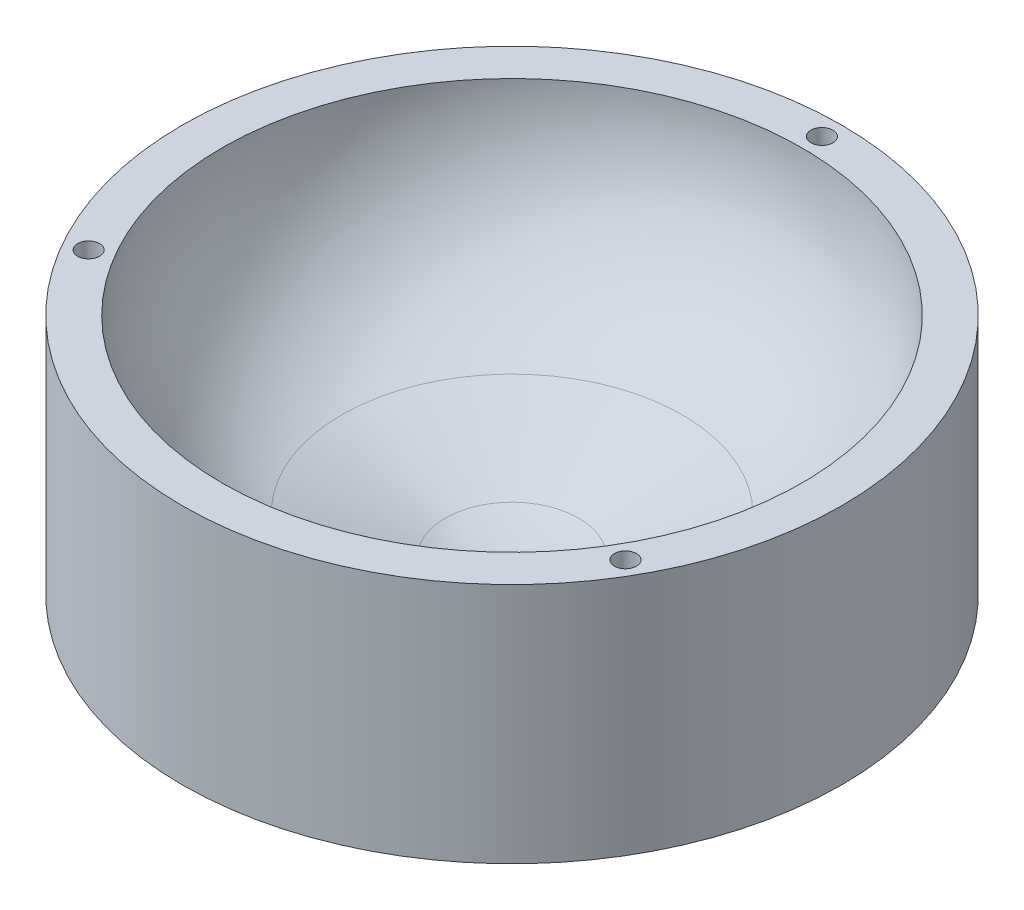
ISO-10303-21;
HEADER;
FILE_DESCRIPTION(('STEP AP214'),'2;1');
FILE_NAME('part.step','',(''),(''),'','','');
FILE_SCHEMA(('AUTOMOTIVE_DESIGN { 1 0 10303 214 1 1 1 1 }'));
ENDSEC;
DATA;
#1=APPLICATION_CONTEXT('core data for automotive mechanical design processes');
#2=APPLICATION_PROTOCOL_DEFINITION('international standard','automotive_design',2000,#1);
#3=PRODUCT_CONTEXT('',#1,'mechanical');
#4=PRODUCT('Part','Part','',(#3));
#5=PRODUCT_RELATED_PRODUCT_CATEGORY('part','',(#4));
#6=PRODUCT_DEFINITION_FORMATION('','',#4);
#7=PRODUCT_DEFINITION_CONTEXT('part definition',#1,'design');
#8=PRODUCT_DEFINITION('design','',#6,#7);
#9=PRODUCT_DEFINITION_SHAPE('','',#8);
#10=(LENGTH_UNIT() NAMED_UNIT(*) SI_UNIT(.MILLI.,.METRE.));
#11=(NAMED_UNIT(*) PLANE_ANGLE_UNIT() SI_UNIT($,.RADIAN.));
#12=(NAMED_UNIT(*) SI_UNIT($,.STERADIAN.) SOLID_ANGLE_UNIT());
#13=UNCERTAINTY_MEASURE_WITH_UNIT(LENGTH_MEASURE(1.E-05),#10,'distance_accuracy_value','');
#14=(GEOMETRIC_REPRESENTATION_CONTEXT(3) GLOBAL_UNCERTAINTY_ASSIGNED_CONTEXT((#13)) GLOBAL_UNIT_ASSIGNED_CONTEXT((#10,
#11,#12)) REPRESENTATION_CONTEXT('',''));
#15=CARTESIAN_POINT('',(0.,0.,0.));
#16=DIRECTION('',(0.,0.,1.));
#17=DIRECTION('',(1.,0.,0.));
#18=AXIS2_PLACEMENT_3D('',#15,#16,#17);
#19=CARTESIAN_POINT('',(0.,34.925,0.));
#20=DIRECTION('',(0.,-1.,0.));
#21=DIRECTION('',(0.,0.,-1.));
#22=AXIS2_PLACEMENT_3D('',#19,#20,#21);
#23=CYLINDRICAL_SURFACE('',#22,95.25);
#24=CARTESIAN_POINT('',(0.,34.925,0.));
#25=DIRECTION('',(0.,1.,0.));
#26=DIRECTION('',(0.,0.,1.));
#27=AXIS2_PLACEMENT_3D('',#24,#25,#26);
#28=CIRCLE('',#27,95.25);
#29=CARTESIAN_POINT('',(0.,34.925,95.25));
#30=VERTEX_POINT('',#29);
#31=EDGE_CURVE('E10',#30,#30,#28,.T.);
#32=ORIENTED_EDGE('',*,*,#31,.F.);
#33=EDGE_LOOP('',(#32));
#34=FACE_BOUND('',#33,.T.);
#35=CARTESIAN_POINT('',(0.,-34.925,0.));
#36=DIRECTION('',(0.,1.,0.));
#37=DIRECTION('',(0.,0.,1.));
#38=AXIS2_PLACEMENT_3D('',#35,#36,#37);
#39=CIRCLE('',#38,95.25);
#40=CARTESIAN_POINT('',(0.,-34.925,95.25));
#41=VERTEX_POINT('',#40);
#42=EDGE_CURVE('E44',#41,#41,#39,.T.);
#43=ORIENTED_EDGE('',*,*,#42,.T.);
#44=EDGE_LOOP('',(#43));
#45=FACE_BOUND('',#44,.T.);
#46=ADVANCED_FACE('F36',(#34,#45),#23,.T.);
#47=CARTESIAN_POINT('',(0.,34.925,0.));
#48=DIRECTION('',(0.,1.,0.));
#49=DIRECTION('',(0.,0.,1.));
#50=AXIS2_PLACEMENT_3D('',#47,#48,#49);
#51=PLANE('',#50);
#52=CARTESIAN_POINT('',(-77.5395845278395,34.925,44.7675000000004));
#53=DIRECTION('',(0.,1.,0.));
#54=DIRECTION('',(0.866025403784436,0.,-0.500000000000004));
#55=AXIS2_PLACEMENT_3D('',#52,#53,#54);
#56=CIRCLE('',#55,3.175);
#57=CARTESIAN_POINT('',(-74.7899538708239,34.925,43.1800000000003));
#58=VERTEX_POINT('',#57);
#59=EDGE_CURVE('E81',#58,#58,#56,.T.);
#60=ORIENTED_EDGE('',*,*,#59,.F.);
#61=EDGE_LOOP('',(#60));
#62=FACE_BOUND('',#61,.T.);
#63=CARTESIAN_POINT('',(77.5395845278401,34.925,44.7674999999993));
#64=DIRECTION('',(0.,1.,0.));
#65=DIRECTION('',(-0.866025403784443,0.,-0.499999999999992));
#66=AXIS2_PLACEMENT_3D('',#63,#64,#65);
#67=CIRCLE('',#66,3.175);
#68=CARTESIAN_POINT('',(74.7899538708245,34.925,43.1799999999993));
#69=VERTEX_POINT('',#68);
#70=EDGE_CURVE('E58',#69,#69,#67,.T.);
#71=ORIENTED_EDGE('',*,*,#70,.F.);
#72=EDGE_LOOP('',(#71));
#73=FACE_BOUND('',#72,.T.);
#74=CARTESIAN_POINT('',(0.,34.925,-89.535));
#75=DIRECTION('',(0.,1.,0.));
#76=DIRECTION('',(0.,0.,1.));
#77=AXIS2_PLACEMENT_3D('',#74,#75,#76);
#78=CIRCLE('',#77,3.175);
#79=CARTESIAN_POINT('',(0.,34.925,-86.36));
#80=VERTEX_POINT('',#79);
#81=EDGE_CURVE('E90',#80,#80,#78,.T.);
#82=ORIENTED_EDGE('',*,*,#81,.F.);
#83=EDGE_LOOP('',(#82));
#84=FACE_BOUND('',#83,.T.);
#85=CARTESIAN_POINT('',(0.,34.925,0.));
#86=DIRECTION('',(0.,1.,0.));
#87=DIRECTION('',(0.812302898165273,0.,0.583235802769599));
#88=AXIS2_PLACEMENT_3D('',#85,#86,#87);
#89=CIRCLE('',#88,83.82000259929);
#90=CARTESIAN_POINT('',(68.087231035624,34.925,48.8868265041468));
#91=VERTEX_POINT('',#90);
#92=EDGE_CURVE('E104',#91,#91,#89,.T.);
#93=ORIENTED_EDGE('',*,*,#92,.F.);
#94=EDGE_LOOP('',(#93));
#95=FACE_BOUND('',#94,.T.);
#96=ORIENTED_EDGE('',*,*,#31,.T.);
#97=EDGE_LOOP('',(#96));
#98=FACE_BOUND('',#97,.T.);
#99=ADVANCED_FACE('F136',(#62,#73,#84,#95,#98),#51,.T.);
#100=CARTESIAN_POINT('',(0.,-34.925,0.));
#101=DIRECTION('',(0.,1.,0.));
#102=DIRECTION('',(0.,0.,1.));
#103=AXIS2_PLACEMENT_3D('',#100,#101,#102);
#104=PLANE('',#103);
#105=CARTESIAN_POINT('',(-6.24500451351651E-13,-34.925,89.535));
#106=DIRECTION('',(0.,1.,0.));
#107=DIRECTION('',(0.,0.,1.));
#108=AXIS2_PLACEMENT_3D('',#105,#106,#107);
#109=CIRCLE('',#108,3.175);
#110=CARTESIAN_POINT('',(-6.24500451351651E-13,-34.925,92.71));
#111=VERTEX_POINT('',#110);
#112=EDGE_CURVE('E39',#111,#111,#109,.T.);
#113=ORIENTED_EDGE('',*,*,#112,.T.);
#114=EDGE_LOOP('',(#113));
#115=FACE_BOUND('',#114,.T.);
#116=CARTESIAN_POINT('',(-77.5395845278392,-34.925,-44.7675000000009));
#117=DIRECTION('',(0.,1.,0.));
#118=DIRECTION('',(0.,0.,1.));
#119=AXIS2_PLACEMENT_3D('',#116,#117,#118);
#120=CIRCLE('',#119,3.175);
#121=CARTESIAN_POINT('',(-77.5395845278392,-34.925,-41.5925000000009));
#122=VERTEX_POINT('',#121);
#123=EDGE_CURVE('E60',#122,#122,#120,.T.);
#124=ORIENTED_EDGE('',*,*,#123,.T.);
#125=EDGE_LOOP('',(#124));
#126=FACE_BOUND('',#125,.T.);
#127=CARTESIAN_POINT('',(77.5395845278398,-34.925,-44.7674999999998));
#128=DIRECTION('',(0.,1.,0.));
#129=DIRECTION('',(0.,0.,1.));
#130=AXIS2_PLACEMENT_3D('',#127,#128,#129);
#131=CIRCLE('',#130,3.175);
#132=CARTESIAN_POINT('',(77.5395845278398,-34.925,-41.5924999999998));
#133=VERTEX_POINT('',#132);
#134=EDGE_CURVE('E55',#133,#133,#131,.T.);
#135=ORIENTED_EDGE('',*,*,#134,.T.);
#136=EDGE_LOOP('',(#135));
#137=FACE_BOUND('',#136,.T.);
#138=CARTESIAN_POINT('',(-77.5395845278395,-34.925,44.7675000000004));
#139=DIRECTION('',(0.,1.,0.));
#140=DIRECTION('',(0.,0.,1.));
#141=AXIS2_PLACEMENT_3D('',#138,#139,#140);
#142=CIRCLE('',#141,3.175);
#143=CARTESIAN_POINT('',(-77.5395845278395,-34.925,47.9425000000004));
#144=VERTEX_POINT('',#143);
#145=EDGE_CURVE('E85',#144,#144,#142,.F.);
#146=ORIENTED_EDGE('',*,*,#145,.F.);
#147=EDGE_LOOP('',(#146));
#148=FACE_BOUND('',#147,.T.);
#149=CARTESIAN_POINT('',(77.5395845278401,-34.925,44.7674999999993));
#150=DIRECTION('',(0.,1.,0.));
#151=DIRECTION('',(0.,0.,1.));
#152=AXIS2_PLACEMENT_3D('',#149,#150,#151);
#153=CIRCLE('',#152,3.175);
#154=CARTESIAN_POINT('',(77.5395845278401,-34.925,47.9424999999993));
#155=VERTEX_POINT('',#154);
#156=EDGE_CURVE('E86',#155,#155,#153,.F.);
#157=ORIENTED_EDGE('',*,*,#156,.F.);
#158=EDGE_LOOP('',(#157));
#159=FACE_BOUND('',#158,.T.);
#160=CARTESIAN_POINT('',(0.,-34.925,-89.535));
#161=DIRECTION('',(0.,1.,0.));
#162=DIRECTION('',(0.,0.,1.));
#163=AXIS2_PLACEMENT_3D('',#160,#161,#162);
#164=CIRCLE('',#163,3.175);
#165=CARTESIAN_POINT('',(0.,-34.925,-86.36));
#166=VERTEX_POINT('',#165);
#167=EDGE_CURVE('E100',#166,#166,#164,.F.);
#168=ORIENTED_EDGE('',*,*,#167,.F.);
#169=EDGE_LOOP('',(#168));
#170=FACE_BOUND('',#169,.T.);
#171=ORIENTED_EDGE('',*,*,#42,.F.);
#172=EDGE_LOOP('',(#171));
#173=FACE_BOUND('',#172,.T.);
#174=ADVANCED_FACE('F133',(#115,#126,#137,#148,#159,#170,#173),#104,.F.);
#175=CARTESIAN_POINT('',(0.,-28.7522112769801,0.));
#176=DIRECTION('',(0.,1.,0.));
#177=DIRECTION('',(0.812302898165273,0.,0.583235802769599));
#178=AXIS2_PLACEMENT_3D('',#175,#176,#177);
#179=PLANE('',#178);
#180=CARTESIAN_POINT('',(0.,-28.7522112769801,0.));
#181=DIRECTION('',(0.,1.,0.));
#182=DIRECTION('',(0.812302898165273,0.,0.583235802769599));
#183=AXIS2_PLACEMENT_3D('',#180,#181,#182);
#184=CIRCLE('',#183,0.381787731454405);
#185=CARTESIAN_POINT('',(0.310127280744358,-28.7522112769801,0.222672274042394));
#186=VERTEX_POINT('',#185);
#187=EDGE_CURVE('E50',#186,#186,#184,.T.);
#188=ORIENTED_EDGE('',*,*,#187,.T.);
#189=EDGE_LOOP('',(#188));
#190=FACE_BOUND('',#189,.T.);
#191=ADVANCED_FACE('F120',(#190),#179,.T.);
#192=CARTESIAN_POINT('',(0.,26.4780229938699,0.));
#193=DIRECTION('',(0.,1.,0.));
#194=DIRECTION('',(0.812302898165273,0.,0.583235802769599));
#195=AXIS2_PLACEMENT_3D('',#192,#193,#194);
#196=DEGENERATE_TOROIDAL_SURFACE('',#195,0.381787731454405,55.23023427085,.T.);
#197=CARTESIAN_POINT('',(0.,-25.4214205947249,0.));
#198=DIRECTION('',(0.,1.,0.));
#199=DIRECTION('',(0.812302898165273,0.,0.583235802769599));
#200=AXIS2_PLACEMENT_3D('',#197,#198,#199);
#201=CIRCLE('',#200,19.2716403726806);
#202=CARTESIAN_POINT('',(15.6544093271273,-25.4214205947249,11.2399106434474));
#203=VERTEX_POINT('',#202);
#204=EDGE_CURVE('E111',#203,#203,#201,.T.);
#205=ORIENTED_EDGE('',*,*,#204,.T.);
#206=EDGE_LOOP('',(#205));
#207=FACE_BOUND('',#206,.T.);
#208=ORIENTED_EDGE('',*,*,#187,.F.);
#209=EDGE_LOOP('',(#208));
#210=FACE_BOUND('',#209,.T.);
#211=ADVANCED_FACE('F122',(#207,#210),#196,.F.);
#212=CARTESIAN_POINT('',(0.,-14.5321168314845,0.));
#213=DIRECTION('',(0.,1.,0.));
#214=DIRECTION('',(0.812302898165273,0.,0.583235802769599));
#215=AXIS2_PLACEMENT_3D('',#212,#213,#214);
#216=CONICAL_SURFACE('',#215,49.1897565757662,1.22173047639603);
#217=CARTESIAN_POINT('',(0.,-14.5321168314845,0.));
#218=DIRECTION('',(0.,1.,0.));
#219=DIRECTION('',(0.812302898165273,0.,0.583235802769599));
#220=AXIS2_PLACEMENT_3D('',#217,#218,#219);
#221=CIRCLE('',#220,49.1897565757662);
#222=CARTESIAN_POINT('',(39.9569818265391,-14.5321168314845,28.6892271645082));
#223=VERTEX_POINT('',#222);
#224=EDGE_CURVE('E108',#223,#223,#221,.T.);
#225=ORIENTED_EDGE('',*,*,#224,.T.);
#226=EDGE_LOOP('',(#225));
#227=FACE_BOUND('',#226,.T.);
#228=ORIENTED_EDGE('',*,*,#204,.F.);
#229=EDGE_LOOP('',(#228));
#230=FACE_BOUND('',#229,.T.);
#231=ADVANCED_FACE('F124',(#227,#230),#216,.F.);
#232=CARTESIAN_POINT('',(0.,34.925,0.));
#233=DIRECTION('',(0.,1.,0.));
#234=DIRECTION('',(0.812302898165273,0.,0.583235802769599));
#235=AXIS2_PLACEMENT_3D('',#232,#233,#234);
#236=DEGENERATE_TOROIDAL_SURFACE('',#235,31.18883817648,52.63116442281,.T.);
#237=ORIENTED_EDGE('',*,*,#92,.T.);
#238=EDGE_LOOP('',(#237));
#239=FACE_BOUND('',#238,.T.);
#240=ORIENTED_EDGE('',*,*,#224,.F.);
#241=EDGE_LOOP('',(#240));
#242=FACE_BOUND('',#241,.T.);
#243=ADVANCED_FACE('F130',(#239,#242),#236,.F.);
#244=CARTESIAN_POINT('',(0.,-43.9052561210691,-89.535));
#245=DIRECTION('',(0.,1.,0.));
#246=DIRECTION('',(0.,0.,1.));
#247=AXIS2_PLACEMENT_3D('',#244,#245,#246);
#248=CYLINDRICAL_SURFACE('',#247,3.175);
#249=ORIENTED_EDGE('',*,*,#167,.T.);
#250=EDGE_LOOP('',(#249));
#251=FACE_BOUND('',#250,.T.);
#252=ORIENTED_EDGE('',*,*,#81,.T.);
#253=EDGE_LOOP('',(#252));
#254=FACE_BOUND('',#253,.T.);
#255=ADVANCED_FACE('F160',(#251,#254),#248,.F.);
#256=CARTESIAN_POINT('',(77.5395845278401,-43.9052561210691,44.7674999999993));
#257=DIRECTION('',(0.,1.,0.));
#258=DIRECTION('',(0.,0.,1.));
#259=AXIS2_PLACEMENT_3D('',#256,#257,#258);
#260=CYLINDRICAL_SURFACE('',#259,3.175);
#261=ORIENTED_EDGE('',*,*,#156,.T.);
#262=EDGE_LOOP('',(#261));
#263=FACE_BOUND('',#262,.T.);
#264=ORIENTED_EDGE('',*,*,#70,.T.);
#265=EDGE_LOOP('',(#264));
#266=FACE_BOUND('',#265,.T.);
#267=ADVANCED_FACE('F163',(#263,#266),#260,.F.);
#268=CARTESIAN_POINT('',(-77.5395845278395,-43.9052561210691,44.7675000000004));
#269=DIRECTION('',(0.,1.,0.));
#270=DIRECTION('',(0.,0.,1.));
#271=AXIS2_PLACEMENT_3D('',#268,#269,#270);
#272=CYLINDRICAL_SURFACE('',#271,3.175);
#273=ORIENTED_EDGE('',*,*,#145,.T.);
#274=EDGE_LOOP('',(#273));
#275=FACE_BOUND('',#274,.T.);
#276=ORIENTED_EDGE('',*,*,#59,.T.);
#277=EDGE_LOOP('',(#276));
#278=FACE_BOUND('',#277,.T.);
#279=ADVANCED_FACE('F180',(#275,#278),#272,.F.);
#280=CARTESIAN_POINT('',(77.5395845278398,-63.5,-44.7674999999998));
#281=DIRECTION('',(0.,1.,0.));
#282=DIRECTION('',(0.,0.,1.));
#283=AXIS2_PLACEMENT_3D('',#280,#281,#282);
#284=CYLINDRICAL_SURFACE('',#283,3.175);
#285=CARTESIAN_POINT('',(77.5395845278398,0.,-44.7674999999998));
#286=DIRECTION('',(0.,1.,0.));
#287=DIRECTION('',(0.,0.,1.));
#288=AXIS2_PLACEMENT_3D('',#285,#286,#287);
#289=CIRCLE('',#288,3.175);
#290=CARTESIAN_POINT('',(77.5395845278398,0.,-41.5924999999998));
#291=VERTEX_POINT('',#290);
#292=EDGE_CURVE('E59',#291,#291,#289,.T.);
#293=ORIENTED_EDGE('',*,*,#292,.T.);
#294=EDGE_LOOP('',(#293));
#295=FACE_BOUND('',#294,.T.);
#296=ORIENTED_EDGE('',*,*,#134,.F.);
#297=EDGE_LOOP('',(#296));
#298=FACE_BOUND('',#297,.T.);
#299=ADVANCED_FACE('F184',(#295,#298),#284,.F.);
#300=CARTESIAN_POINT('',(77.5395845278398,0.,-44.7674999999998));
#301=DIRECTION('',(0.,1.,0.));
#302=DIRECTION('',(0.,0.,1.));
#303=AXIS2_PLACEMENT_3D('',#300,#301,#302);
#304=PLANE('',#303);
#305=ORIENTED_EDGE('',*,*,#292,.F.);
#306=EDGE_LOOP('',(#305));
#307=FACE_BOUND('',#306,.T.);
#308=ADVANCED_FACE('F188',(#307),#304,.F.);
#309=CARTESIAN_POINT('',(-77.5395845278392,-63.5,-44.7675000000009));
#310=DIRECTION('',(0.,1.,0.));
#311=DIRECTION('',(0.,0.,1.));
#312=AXIS2_PLACEMENT_3D('',#309,#310,#311);
#313=CYLINDRICAL_SURFACE('',#312,3.175);
#314=CARTESIAN_POINT('',(-77.5395845278392,0.,-44.7675000000009));
#315=DIRECTION('',(0.,1.,0.));
#316=DIRECTION('',(0.866025403784443,0.,-0.499999999999992));
#317=AXIS2_PLACEMENT_3D('',#314,#315,#316);
#318=CIRCLE('',#317,3.175);
#319=CARTESIAN_POINT('',(-74.7899538708236,0.,-46.3550000000009));
#320=VERTEX_POINT('',#319);
#321=EDGE_CURVE('E70',#320,#320,#318,.T.);
#322=ORIENTED_EDGE('',*,*,#321,.T.);
#323=EDGE_LOOP('',(#322));
#324=FACE_BOUND('',#323,.T.);
#325=ORIENTED_EDGE('',*,*,#123,.F.);
#326=EDGE_LOOP('',(#325));
#327=FACE_BOUND('',#326,.T.);
#328=ADVANCED_FACE('F192',(#324,#327),#313,.F.);
#329=CARTESIAN_POINT('',(-77.5395845278392,0.,-44.7675000000009));
#330=DIRECTION('',(0.,1.,0.));
#331=DIRECTION('',(0.866025403784443,0.,-0.499999999999992));
#332=AXIS2_PLACEMENT_3D('',#329,#330,#331);
#333=PLANE('',#332);
#334=ORIENTED_EDGE('',*,*,#321,.F.);
#335=EDGE_LOOP('',(#334));
#336=FACE_BOUND('',#335,.T.);
#337=ADVANCED_FACE('F196',(#336),#333,.F.);
#338=CARTESIAN_POINT('',(-6.24500451351651E-13,-63.5,89.535));
#339=DIRECTION('',(0.,1.,0.));
#340=DIRECTION('',(0.,0.,1.));
#341=AXIS2_PLACEMENT_3D('',#338,#339,#340);
#342=CYLINDRICAL_SURFACE('',#341,3.175);
#343=CARTESIAN_POINT('',(-6.24500451351651E-13,0.,89.535));
#344=DIRECTION('',(0.,1.,0.));
#345=DIRECTION('',(-0.866025403784436,0.,-0.500000000000004));
#346=AXIS2_PLACEMENT_3D('',#343,#344,#345);
#347=CIRCLE('',#346,3.175);
#348=CARTESIAN_POINT('',(-2.74963065701621,0.,87.9475));
#349=VERTEX_POINT('',#348);
#350=EDGE_CURVE('E63',#349,#349,#347,.T.);
#351=ORIENTED_EDGE('',*,*,#350,.T.);
#352=EDGE_LOOP('',(#351));
#353=FACE_BOUND('',#352,.T.);
#354=ORIENTED_EDGE('',*,*,#112,.F.);
#355=EDGE_LOOP('',(#354));
#356=FACE_BOUND('',#355,.T.);
#357=ADVANCED_FACE('F200',(#353,#356),#342,.F.);
#358=CARTESIAN_POINT('',(-6.24500451351651E-13,0.,89.535));
#359=DIRECTION('',(0.,1.,0.));
#360=DIRECTION('',(-0.866025403784436,0.,-0.500000000000004));
#361=AXIS2_PLACEMENT_3D('',#358,#359,#360);
#362=PLANE('',#361);
#363=ORIENTED_EDGE('',*,*,#350,.F.);
#364=EDGE_LOOP('',(#363));
#365=FACE_BOUND('',#364,.T.);
#366=ADVANCED_FACE('F204',(#365),#362,.F.);
#367=CLOSED_SHELL('',(#46,#99,#174,#191,#211,#231,#243,#255,#267,#279,#299,#308,#328,#337,#357,#366));
#368=MANIFOLD_SOLID_BREP('B2',#367);
#369=ADVANCED_BREP_SHAPE_REPRESENTATION('',(#18,#368),#14);
#370=SHAPE_DEFINITION_REPRESENTATION(#9,#369);
ENDSEC;
END-ISO-10303-21;
